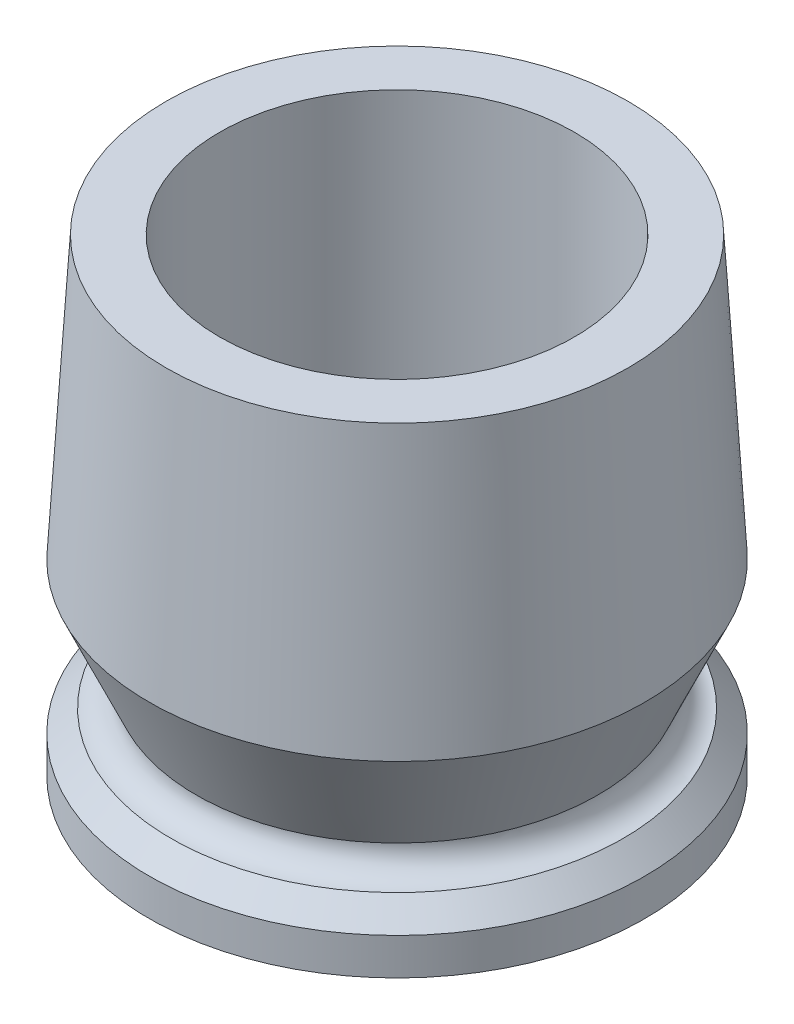
ISO-10303-21;
HEADER;
FILE_DESCRIPTION(('STEP AP214'),'2;1');
FILE_NAME('part.step','',(''),(''),'','','');
FILE_SCHEMA(('AUTOMOTIVE_DESIGN { 1 0 10303 214 1 1 1 1 }'));
ENDSEC;
DATA;
#1=APPLICATION_CONTEXT('core data for automotive mechanical design processes');
#2=APPLICATION_PROTOCOL_DEFINITION('international standard','automotive_design',2000,#1);
#3=PRODUCT_CONTEXT('',#1,'mechanical');
#4=PRODUCT('Part','Part','',(#3));
#5=PRODUCT_RELATED_PRODUCT_CATEGORY('part','',(#4));
#6=PRODUCT_DEFINITION_FORMATION('','',#4);
#7=PRODUCT_DEFINITION_CONTEXT('part definition',#1,'design');
#8=PRODUCT_DEFINITION('design','',#6,#7);
#9=PRODUCT_DEFINITION_SHAPE('','',#8);
#10=(LENGTH_UNIT() NAMED_UNIT(*) SI_UNIT(.MILLI.,.METRE.));
#11=(NAMED_UNIT(*) PLANE_ANGLE_UNIT() SI_UNIT($,.RADIAN.));
#12=(NAMED_UNIT(*) SI_UNIT($,.STERADIAN.) SOLID_ANGLE_UNIT());
#13=UNCERTAINTY_MEASURE_WITH_UNIT(LENGTH_MEASURE(1.E-05),#10,'distance_accuracy_value','');
#14=(GEOMETRIC_REPRESENTATION_CONTEXT(3) GLOBAL_UNCERTAINTY_ASSIGNED_CONTEXT((#13)) GLOBAL_UNIT_ASSIGNED_CONTEXT((#10,
#11,#12)) REPRESENTATION_CONTEXT('',''));
#15=CARTESIAN_POINT('',(0.,0.,0.));
#16=DIRECTION('',(0.,0.,1.));
#17=DIRECTION('',(1.,0.,0.));
#18=AXIS2_PLACEMENT_3D('',#15,#16,#17);
#19=CARTESIAN_POINT('',(37.,0.,0.));
#20=DIRECTION('',(0.,-1.,0.));
#21=DIRECTION('',(0.,0.,-1.));
#22=AXIS2_PLACEMENT_3D('',#19,#20,#21);
#23=PLANE('',#22);
#24=CARTESIAN_POINT('',(0.,0.,0.));
#25=DIRECTION('',(0.,1.,0.));
#26=DIRECTION('',(0.,0.,1.));
#27=AXIS2_PLACEMENT_3D('',#24,#25,#26);
#28=CIRCLE('',#27,26.5);
#29=CARTESIAN_POINT('',(0.,0.,26.5));
#30=VERTEX_POINT('',#29);
#31=EDGE_CURVE('E60',#30,#30,#28,.T.);
#32=ORIENTED_EDGE('',*,*,#31,.T.);
#33=EDGE_LOOP('',(#32));
#34=FACE_BOUND('',#33,.T.);
#35=CARTESIAN_POINT('',(0.,0.,0.));
#36=DIRECTION('',(0.,-1.,0.));
#37=DIRECTION('',(0.,0.,-1.));
#38=AXIS2_PLACEMENT_3D('',#35,#36,#37);
#39=CIRCLE('',#38,37.);
#40=CARTESIAN_POINT('',(0.,0.,-37.));
#41=VERTEX_POINT('',#40);
#42=EDGE_CURVE('E10',#41,#41,#39,.T.);
#43=ORIENTED_EDGE('',*,*,#42,.T.);
#44=EDGE_LOOP('',(#43));
#45=FACE_BOUND('',#44,.T.);
#46=ADVANCED_FACE('F35',(#34,#45),#23,.T.);
#47=CARTESIAN_POINT('',(0.,0.,0.));
#48=DIRECTION('',(0.,-1.,0.));
#49=DIRECTION('',(0.,0.,-1.));
#50=AXIS2_PLACEMENT_3D('',#47,#48,#49);
#51=CYLINDRICAL_SURFACE('',#50,37.);
#52=CARTESIAN_POINT('',(0.,5.5,0.));
#53=DIRECTION('',(0.,-1.,0.));
#54=DIRECTION('',(0.,0.,-1.));
#55=AXIS2_PLACEMENT_3D('',#52,#53,#54);
#56=CIRCLE('',#55,37.);
#57=CARTESIAN_POINT('',(0.,5.5,-37.));
#58=VERTEX_POINT('',#57);
#59=EDGE_CURVE('E41',#58,#58,#56,.T.);
#60=ORIENTED_EDGE('',*,*,#59,.T.);
#61=EDGE_LOOP('',(#60));
#62=FACE_BOUND('',#61,.T.);
#63=ORIENTED_EDGE('',*,*,#42,.F.);
#64=EDGE_LOOP('',(#63));
#65=FACE_BOUND('',#64,.T.);
#66=ADVANCED_FACE('F101',(#62,#65),#51,.T.);
#67=CARTESIAN_POINT('',(0.,5.5,0.));
#68=DIRECTION('',(0.,-1.,0.));
#69=DIRECTION('',(0.,0.,-1.));
#70=AXIS2_PLACEMENT_3D('',#67,#68,#69);
#71=CONICAL_SURFACE('',#70,37.,0.78539816339745);
#72=CARTESIAN_POINT('',(0.,8.74999999999998,0.));
#73=DIRECTION('',(0.,-1.,0.));
#74=DIRECTION('',(0.,0.,-1.));
#75=AXIS2_PLACEMENT_3D('',#72,#73,#74);
#76=CIRCLE('',#75,33.75);
#77=CARTESIAN_POINT('',(0.,8.74999999999998,-33.75));
#78=VERTEX_POINT('',#77);
#79=EDGE_CURVE('E45',#78,#78,#76,.T.);
#80=ORIENTED_EDGE('',*,*,#79,.T.);
#81=EDGE_LOOP('',(#80));
#82=FACE_BOUND('',#81,.T.);
#83=ORIENTED_EDGE('',*,*,#59,.F.);
#84=EDGE_LOOP('',(#83));
#85=FACE_BOUND('',#84,.T.);
#86=ADVANCED_FACE('F95',(#82,#85),#71,.T.);
#87=CARTESIAN_POINT('',(0.,12.5,0.));
#88=DIRECTION('',(0.,-1.,0.));
#89=DIRECTION('',(0.,0.,-1.));
#90=AXIS2_PLACEMENT_3D('',#87,#88,#89);
#91=TOROIDAL_SURFACE('',#90,33.75,3.75);
#92=CARTESIAN_POINT('',(0.,12.5,0.));
#93=DIRECTION('',(0.,-1.,0.));
#94=DIRECTION('',(0.,0.,-1.));
#95=AXIS2_PLACEMENT_3D('',#92,#93,#94);
#96=CIRCLE('',#95,30.);
#97=CARTESIAN_POINT('',(0.,12.5,-30.));
#98=VERTEX_POINT('',#97);
#99=EDGE_CURVE('E49',#98,#98,#96,.T.);
#100=ORIENTED_EDGE('',*,*,#99,.T.);
#101=EDGE_LOOP('',(#100));
#102=FACE_BOUND('',#101,.T.);
#103=ORIENTED_EDGE('',*,*,#79,.F.);
#104=EDGE_LOOP('',(#103));
#105=FACE_BOUND('',#104,.T.);
#106=ADVANCED_FACE('F89',(#102,#105),#91,.F.);
#107=CARTESIAN_POINT('',(0.,12.5,0.));
#108=DIRECTION('',(0.,1.,0.));
#109=DIRECTION('',(0.,0.,1.));
#110=AXIS2_PLACEMENT_3D('',#107,#108,#109);
#111=CONICAL_SURFACE('',#110,30.,0.424194407903766);
#112=CARTESIAN_POINT('',(0.,28.,0.));
#113=DIRECTION('',(0.,-1.,0.));
#114=DIRECTION('',(0.,0.,-1.));
#115=AXIS2_PLACEMENT_3D('',#112,#113,#114);
#116=CIRCLE('',#115,37.);
#117=CARTESIAN_POINT('',(0.,28.,-37.));
#118=VERTEX_POINT('',#117);
#119=EDGE_CURVE('E54',#118,#118,#116,.T.);
#120=ORIENTED_EDGE('',*,*,#119,.T.);
#121=EDGE_LOOP('',(#120));
#122=FACE_BOUND('',#121,.T.);
#123=ORIENTED_EDGE('',*,*,#99,.F.);
#124=EDGE_LOOP('',(#123));
#125=FACE_BOUND('',#124,.T.);
#126=ADVANCED_FACE('F83',(#122,#125),#111,.T.);
#127=CARTESIAN_POINT('',(0.,28.,0.));
#128=DIRECTION('',(0.,-1.,0.));
#129=DIRECTION('',(0.,0.,-1.));
#130=AXIS2_PLACEMENT_3D('',#127,#128,#129);
#131=CONICAL_SURFACE('',#130,37.,0.0594536593086568);
#132=CARTESIAN_POINT('',(0.,70.,0.));
#133=DIRECTION('',(0.,-1.,0.));
#134=DIRECTION('',(0.,0.,-1.));
#135=AXIS2_PLACEMENT_3D('',#132,#133,#134);
#136=CIRCLE('',#135,34.5);
#137=CARTESIAN_POINT('',(0.,70.,-34.5));
#138=VERTEX_POINT('',#137);
#139=EDGE_CURVE('E57',#138,#138,#136,.T.);
#140=ORIENTED_EDGE('',*,*,#139,.T.);
#141=EDGE_LOOP('',(#140));
#142=FACE_BOUND('',#141,.T.);
#143=ORIENTED_EDGE('',*,*,#119,.F.);
#144=EDGE_LOOP('',(#143));
#145=FACE_BOUND('',#144,.T.);
#146=ADVANCED_FACE('F77',(#142,#145),#131,.T.);
#147=CARTESIAN_POINT('',(0.,70.,0.));
#148=DIRECTION('',(0.,1.,0.));
#149=DIRECTION('',(0.,0.,1.));
#150=AXIS2_PLACEMENT_3D('',#147,#148,#149);
#151=PLANE('',#150);
#152=CARTESIAN_POINT('',(0.,70.,0.));
#153=DIRECTION('',(0.,1.,0.));
#154=DIRECTION('',(0.,0.,1.));
#155=AXIS2_PLACEMENT_3D('',#152,#153,#154);
#156=CIRCLE('',#155,26.5);
#157=CARTESIAN_POINT('',(0.,70.,26.5));
#158=VERTEX_POINT('',#157);
#159=EDGE_CURVE('E61',#158,#158,#156,.T.);
#160=ORIENTED_EDGE('',*,*,#159,.F.);
#161=EDGE_LOOP('',(#160));
#162=FACE_BOUND('',#161,.T.);
#163=ORIENTED_EDGE('',*,*,#139,.F.);
#164=EDGE_LOOP('',(#163));
#165=FACE_BOUND('',#164,.T.);
#166=ADVANCED_FACE('F71',(#162,#165),#151,.T.);
#167=CARTESIAN_POINT('',(0.,0.,0.));
#168=DIRECTION('',(0.,1.,0.));
#169=DIRECTION('',(0.,0.,1.));
#170=AXIS2_PLACEMENT_3D('',#167,#168,#169);
#171=CYLINDRICAL_SURFACE('',#170,26.5);
#172=ORIENTED_EDGE('',*,*,#31,.F.);
#173=EDGE_LOOP('',(#172));
#174=FACE_BOUND('',#173,.T.);
#175=ORIENTED_EDGE('',*,*,#159,.T.);
#176=EDGE_LOOP('',(#175));
#177=FACE_BOUND('',#176,.T.);
#178=ADVANCED_FACE('F68',(#174,#177),#171,.F.);
#179=CLOSED_SHELL('',(#46,#66,#86,#106,#126,#146,#166,#178));
#180=MANIFOLD_SOLID_BREP('B2',#179);
#181=ADVANCED_BREP_SHAPE_REPRESENTATION('',(#18,#180),#14);
#182=SHAPE_DEFINITION_REPRESENTATION(#9,#181);
ENDSEC;
END-ISO-10303-21;
